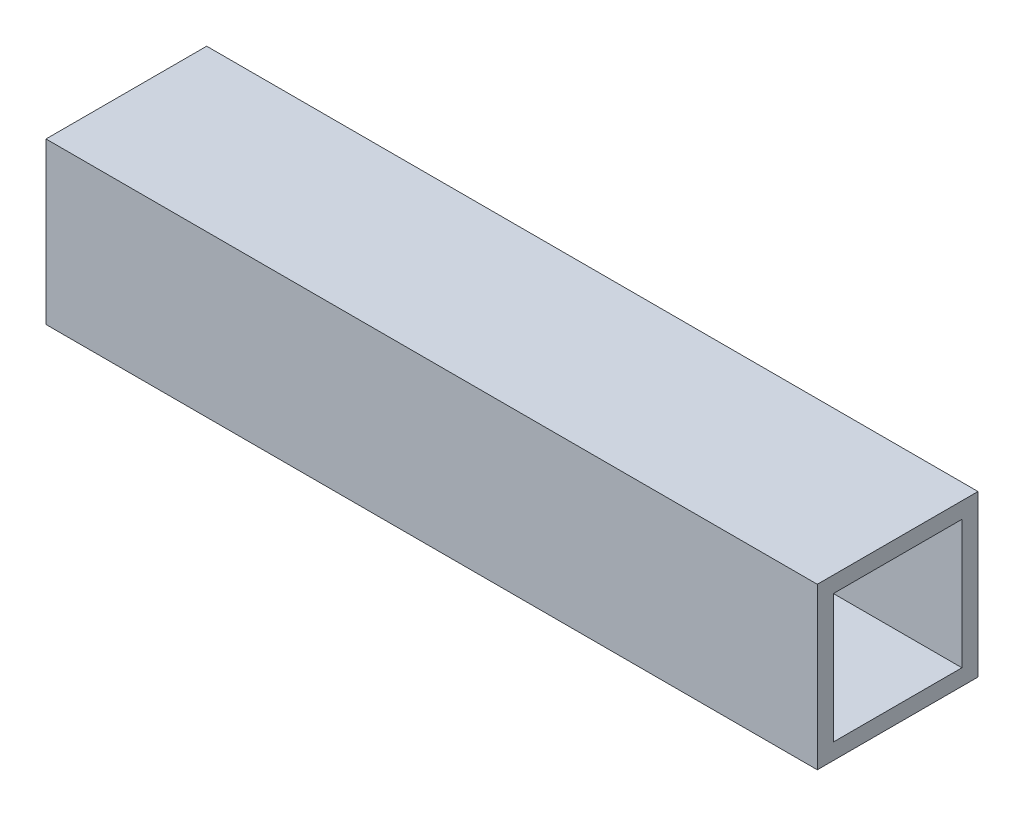
ISO-10303-21;
HEADER;
FILE_DESCRIPTION(('STEP AP214'),'2;1');
FILE_NAME('part.step','',(''),(''),'','','');
FILE_SCHEMA(('AUTOMOTIVE_DESIGN { 1 0 10303 214 1 1 1 1 }'));
ENDSEC;
DATA;
#1=APPLICATION_CONTEXT('core data for automotive mechanical design processes');
#2=APPLICATION_PROTOCOL_DEFINITION('international standard','automotive_design',2000,#1);
#3=PRODUCT_CONTEXT('',#1,'mechanical');
#4=PRODUCT('Part','Part','',(#3));
#5=PRODUCT_RELATED_PRODUCT_CATEGORY('part','',(#4));
#6=PRODUCT_DEFINITION_FORMATION('','',#4);
#7=PRODUCT_DEFINITION_CONTEXT('part definition',#1,'design');
#8=PRODUCT_DEFINITION('design','',#6,#7);
#9=PRODUCT_DEFINITION_SHAPE('','',#8);
#10=(LENGTH_UNIT() NAMED_UNIT(*) SI_UNIT(.MILLI.,.METRE.));
#11=(NAMED_UNIT(*) PLANE_ANGLE_UNIT() SI_UNIT($,.RADIAN.));
#12=(NAMED_UNIT(*) SI_UNIT($,.STERADIAN.) SOLID_ANGLE_UNIT());
#13=UNCERTAINTY_MEASURE_WITH_UNIT(LENGTH_MEASURE(1.E-05),#10,'distance_accuracy_value','');
#14=(GEOMETRIC_REPRESENTATION_CONTEXT(3) GLOBAL_UNCERTAINTY_ASSIGNED_CONTEXT((#13)) GLOBAL_UNIT_ASSIGNED_CONTEXT((#10,
#11,#12)) REPRESENTATION_CONTEXT('',''));
#15=CARTESIAN_POINT('',(0.,0.,0.));
#16=DIRECTION('',(0.,0.,1.));
#17=DIRECTION('',(1.,0.,0.));
#18=AXIS2_PLACEMENT_3D('',#15,#16,#17);
#19=CARTESIAN_POINT('',(152.4,0.,0.));
#20=DIRECTION('',(1.,0.,0.));
#21=DIRECTION('',(0.,0.,-1.));
#22=AXIS2_PLACEMENT_3D('',#19,#20,#21);
#23=PLANE('',#22);
#24=DIRECTION('',(0.,0.,-1.));
#25=VECTOR('',#24,1.);
#26=CARTESIAN_POINT('',(152.4,-31.75,31.75));
#27=LINE('',#26,#25);
#28=CARTESIAN_POINT('',(152.4,-31.75,31.75));
#29=VERTEX_POINT('',#28);
#30=CARTESIAN_POINT('',(152.4,-31.75,-31.75));
#31=VERTEX_POINT('',#30);
#32=EDGE_CURVE('E136',#29,#31,#27,.T.);
#33=ORIENTED_EDGE('',*,*,#32,.T.);
#34=DIRECTION('',(0.,1.,0.));
#35=VECTOR('',#34,1.);
#36=CARTESIAN_POINT('',(152.4,-31.75,-31.75));
#37=LINE('',#36,#35);
#38=CARTESIAN_POINT('',(152.4,31.75,-31.75));
#39=VERTEX_POINT('',#38);
#40=EDGE_CURVE('E139',#31,#39,#37,.T.);
#41=ORIENTED_EDGE('',*,*,#40,.T.);
#42=DIRECTION('',(0.,0.,1.));
#43=VECTOR('',#42,1.);
#44=CARTESIAN_POINT('',(152.4,31.75,31.75));
#45=LINE('',#44,#43);
#46=CARTESIAN_POINT('',(152.4,31.75,31.75));
#47=VERTEX_POINT('',#46);
#48=EDGE_CURVE('E142',#39,#47,#45,.T.);
#49=ORIENTED_EDGE('',*,*,#48,.T.);
#50=DIRECTION('',(0.,-1.,0.));
#51=VECTOR('',#50,1.);
#52=CARTESIAN_POINT('',(152.4,-31.75,31.75));
#53=LINE('',#52,#51);
#54=EDGE_CURVE('E144',#47,#29,#53,.T.);
#55=ORIENTED_EDGE('',*,*,#54,.T.);
#56=EDGE_LOOP('',(#33,#41,#49,#55));
#57=FACE_BOUND('',#56,.T.);
#58=DIRECTION('',(0.,0.,1.));
#59=VECTOR('',#58,1.);
#60=CARTESIAN_POINT('',(152.4,25.4,25.4));
#61=LINE('',#60,#59);
#62=CARTESIAN_POINT('',(152.4,25.4,-25.4));
#63=VERTEX_POINT('',#62);
#64=CARTESIAN_POINT('',(152.4,25.4,25.4));
#65=VERTEX_POINT('',#64);
#66=EDGE_CURVE('E108',#63,#65,#61,.T.);
#67=ORIENTED_EDGE('',*,*,#66,.F.);
#68=DIRECTION('',(0.,1.,0.));
#69=VECTOR('',#68,1.);
#70=CARTESIAN_POINT('',(152.4,-25.4,-25.4));
#71=LINE('',#70,#69);
#72=CARTESIAN_POINT('',(152.4,-25.4,-25.4));
#73=VERTEX_POINT('',#72);
#74=EDGE_CURVE('E100',#73,#63,#71,.T.);
#75=ORIENTED_EDGE('',*,*,#74,.F.);
#76=DIRECTION('',(0.,0.,-1.));
#77=VECTOR('',#76,1.);
#78=CARTESIAN_POINT('',(152.4,-25.4,25.4));
#79=LINE('',#78,#77);
#80=CARTESIAN_POINT('',(152.4,-25.4,25.4));
#81=VERTEX_POINT('',#80);
#82=EDGE_CURVE('E122',#81,#73,#79,.T.);
#83=ORIENTED_EDGE('',*,*,#82,.F.);
#84=DIRECTION('',(0.,-1.,0.));
#85=VECTOR('',#84,1.);
#86=CARTESIAN_POINT('',(152.4,-25.4,25.4));
#87=LINE('',#86,#85);
#88=EDGE_CURVE('E120',#65,#81,#87,.T.);
#89=ORIENTED_EDGE('',*,*,#88,.F.);
#90=EDGE_LOOP('',(#67,#75,#83,#89));
#91=FACE_BOUND('',#90,.T.);
#92=ADVANCED_FACE('F35',(#57,#91),#23,.T.);
#93=CARTESIAN_POINT('',(-152.4,0.,0.));
#94=DIRECTION('',(1.,0.,0.));
#95=DIRECTION('',(0.,0.,-1.));
#96=AXIS2_PLACEMENT_3D('',#93,#94,#95);
#97=PLANE('',#96);
#98=DIRECTION('',(0.,0.,-1.));
#99=VECTOR('',#98,1.);
#100=CARTESIAN_POINT('',(-152.4,-31.75,31.75));
#101=LINE('',#100,#99);
#102=CARTESIAN_POINT('',(-152.4,-31.75,31.75));
#103=VERTEX_POINT('',#102);
#104=CARTESIAN_POINT('',(-152.4,-31.75,-31.75));
#105=VERTEX_POINT('',#104);
#106=EDGE_CURVE('E116',#103,#105,#101,.T.);
#107=ORIENTED_EDGE('',*,*,#106,.F.);
#108=DIRECTION('',(0.,-1.,0.));
#109=VECTOR('',#108,1.);
#110=CARTESIAN_POINT('',(-152.4,-31.75,31.75));
#111=LINE('',#110,#109);
#112=CARTESIAN_POINT('',(-152.4,31.75,31.75));
#113=VERTEX_POINT('',#112);
#114=EDGE_CURVE('E140',#113,#103,#111,.T.);
#115=ORIENTED_EDGE('',*,*,#114,.F.);
#116=DIRECTION('',(0.,0.,1.));
#117=VECTOR('',#116,1.);
#118=CARTESIAN_POINT('',(-152.4,31.75,31.75));
#119=LINE('',#118,#117);
#120=CARTESIAN_POINT('',(-152.4,31.75,-31.75));
#121=VERTEX_POINT('',#120);
#122=EDGE_CURVE('E151',#121,#113,#119,.T.);
#123=ORIENTED_EDGE('',*,*,#122,.F.);
#124=DIRECTION('',(0.,1.,0.));
#125=VECTOR('',#124,1.);
#126=CARTESIAN_POINT('',(-152.4,-31.75,-31.75));
#127=LINE('',#126,#125);
#128=EDGE_CURVE('E149',#105,#121,#127,.T.);
#129=ORIENTED_EDGE('',*,*,#128,.F.);
#130=EDGE_LOOP('',(#107,#115,#123,#129));
#131=FACE_BOUND('',#130,.T.);
#132=DIRECTION('',(0.,1.,0.));
#133=VECTOR('',#132,1.);
#134=CARTESIAN_POINT('',(-152.4,-25.4,-25.4));
#135=LINE('',#134,#133);
#136=CARTESIAN_POINT('',(-152.4,-25.4,-25.4));
#137=VERTEX_POINT('',#136);
#138=CARTESIAN_POINT('',(-152.4,25.4,-25.4));
#139=VERTEX_POINT('',#138);
#140=EDGE_CURVE('E58',#137,#139,#135,.T.);
#141=ORIENTED_EDGE('',*,*,#140,.T.);
#142=DIRECTION('',(0.,0.,1.));
#143=VECTOR('',#142,1.);
#144=CARTESIAN_POINT('',(-152.4,25.4,25.4));
#145=LINE('',#144,#143);
#146=CARTESIAN_POINT('',(-152.4,25.4,25.4));
#147=VERTEX_POINT('',#146);
#148=EDGE_CURVE('E115',#139,#147,#145,.T.);
#149=ORIENTED_EDGE('',*,*,#148,.T.);
#150=DIRECTION('',(0.,-1.,0.));
#151=VECTOR('',#150,1.);
#152=CARTESIAN_POINT('',(-152.4,-25.4,25.4));
#153=LINE('',#152,#151);
#154=CARTESIAN_POINT('',(-152.4,-25.4,25.4));
#155=VERTEX_POINT('',#154);
#156=EDGE_CURVE('E128',#147,#155,#153,.T.);
#157=ORIENTED_EDGE('',*,*,#156,.T.);
#158=DIRECTION('',(0.,0.,-1.));
#159=VECTOR('',#158,1.);
#160=CARTESIAN_POINT('',(-152.4,-25.4,25.4));
#161=LINE('',#160,#159);
#162=EDGE_CURVE('E109',#155,#137,#161,.T.);
#163=ORIENTED_EDGE('',*,*,#162,.T.);
#164=EDGE_LOOP('',(#141,#149,#157,#163));
#165=FACE_BOUND('',#164,.T.);
#166=ADVANCED_FACE('F169',(#131,#165),#97,.F.);
#167=CARTESIAN_POINT('',(152.4,-31.75,31.75));
#168=DIRECTION('',(0.,1.,0.));
#169=DIRECTION('',(0.,0.,1.));
#170=AXIS2_PLACEMENT_3D('',#167,#168,#169);
#171=PLANE('',#170);
#172=ORIENTED_EDGE('',*,*,#106,.T.);
#173=DIRECTION('',(-1.,0.,0.));
#174=VECTOR('',#173,1.);
#175=CARTESIAN_POINT('',(152.4,-31.75,-31.75));
#176=LINE('',#175,#174);
#177=EDGE_CURVE('E11',#31,#105,#176,.T.);
#178=ORIENTED_EDGE('',*,*,#177,.F.);
#179=ORIENTED_EDGE('',*,*,#32,.F.);
#180=DIRECTION('',(-1.,0.,0.));
#181=VECTOR('',#180,1.);
#182=CARTESIAN_POINT('',(152.4,-31.75,31.75));
#183=LINE('',#182,#181);
#184=EDGE_CURVE('E146',#29,#103,#183,.T.);
#185=ORIENTED_EDGE('',*,*,#184,.T.);
#186=EDGE_LOOP('',(#172,#178,#179,#185));
#187=FACE_BOUND('',#186,.T.);
#188=ADVANCED_FACE('F37',(#187),#171,.F.);
#189=CARTESIAN_POINT('',(152.4,-31.75,-31.75));
#190=DIRECTION('',(0.,0.,1.));
#191=DIRECTION('',(1.,0.,0.));
#192=AXIS2_PLACEMENT_3D('',#189,#190,#191);
#193=PLANE('',#192);
#194=ORIENTED_EDGE('',*,*,#128,.T.);
#195=DIRECTION('',(-1.,0.,0.));
#196=VECTOR('',#195,1.);
#197=CARTESIAN_POINT('',(152.4,31.75,-31.75));
#198=LINE('',#197,#196);
#199=EDGE_CURVE('E43',#39,#121,#198,.T.);
#200=ORIENTED_EDGE('',*,*,#199,.F.);
#201=ORIENTED_EDGE('',*,*,#40,.F.);
#202=ORIENTED_EDGE('',*,*,#177,.T.);
#203=EDGE_LOOP('',(#194,#200,#201,#202));
#204=FACE_BOUND('',#203,.T.);
#205=ADVANCED_FACE('F179',(#204),#193,.F.);
#206=CARTESIAN_POINT('',(152.4,31.75,31.75));
#207=DIRECTION('',(0.,-1.,0.));
#208=DIRECTION('',(0.,0.,-1.));
#209=AXIS2_PLACEMENT_3D('',#206,#207,#208);
#210=PLANE('',#209);
#211=ORIENTED_EDGE('',*,*,#122,.T.);
#212=DIRECTION('',(-1.,0.,0.));
#213=VECTOR('',#212,1.);
#214=CARTESIAN_POINT('',(152.4,31.75,31.75));
#215=LINE('',#214,#213);
#216=EDGE_CURVE('E156',#47,#113,#215,.T.);
#217=ORIENTED_EDGE('',*,*,#216,.F.);
#218=ORIENTED_EDGE('',*,*,#48,.F.);
#219=ORIENTED_EDGE('',*,*,#199,.T.);
#220=EDGE_LOOP('',(#211,#217,#218,#219));
#221=FACE_BOUND('',#220,.T.);
#222=ADVANCED_FACE('F163',(#221),#210,.F.);
#223=CARTESIAN_POINT('',(152.4,-31.75,31.75));
#224=DIRECTION('',(0.,0.,-1.));
#225=DIRECTION('',(-1.,0.,0.));
#226=AXIS2_PLACEMENT_3D('',#223,#224,#225);
#227=PLANE('',#226);
#228=ORIENTED_EDGE('',*,*,#114,.T.);
#229=ORIENTED_EDGE('',*,*,#184,.F.);
#230=ORIENTED_EDGE('',*,*,#54,.F.);
#231=ORIENTED_EDGE('',*,*,#216,.T.);
#232=EDGE_LOOP('',(#228,#229,#230,#231));
#233=FACE_BOUND('',#232,.T.);
#234=ADVANCED_FACE('F173',(#233),#227,.F.);
#235=CARTESIAN_POINT('',(152.4,-25.4,-25.4));
#236=DIRECTION('',(0.,0.,1.));
#237=DIRECTION('',(1.,0.,0.));
#238=AXIS2_PLACEMENT_3D('',#235,#236,#237);
#239=PLANE('',#238);
#240=ORIENTED_EDGE('',*,*,#140,.F.);
#241=DIRECTION('',(-1.,0.,0.));
#242=VECTOR('',#241,1.);
#243=CARTESIAN_POINT('',(152.4,-25.4,-25.4));
#244=LINE('',#243,#242);
#245=EDGE_CURVE('E104',#73,#137,#244,.T.);
#246=ORIENTED_EDGE('',*,*,#245,.F.);
#247=ORIENTED_EDGE('',*,*,#74,.T.);
#248=DIRECTION('',(-1.,0.,0.));
#249=VECTOR('',#248,1.);
#250=CARTESIAN_POINT('',(152.4,25.4,-25.4));
#251=LINE('',#250,#249);
#252=EDGE_CURVE('E103',#63,#139,#251,.T.);
#253=ORIENTED_EDGE('',*,*,#252,.T.);
#254=EDGE_LOOP('',(#240,#246,#247,#253));
#255=FACE_BOUND('',#254,.T.);
#256=ADVANCED_FACE('F102',(#255),#239,.T.);
#257=CARTESIAN_POINT('',(152.4,25.4,25.4));
#258=DIRECTION('',(0.,-1.,0.));
#259=DIRECTION('',(0.,0.,-1.));
#260=AXIS2_PLACEMENT_3D('',#257,#258,#259);
#261=PLANE('',#260);
#262=ORIENTED_EDGE('',*,*,#148,.F.);
#263=ORIENTED_EDGE('',*,*,#252,.F.);
#264=ORIENTED_EDGE('',*,*,#66,.T.);
#265=DIRECTION('',(-1.,0.,0.));
#266=VECTOR('',#265,1.);
#267=CARTESIAN_POINT('',(152.4,25.4,25.4));
#268=LINE('',#267,#266);
#269=EDGE_CURVE('E117',#65,#147,#268,.T.);
#270=ORIENTED_EDGE('',*,*,#269,.T.);
#271=EDGE_LOOP('',(#262,#263,#264,#270));
#272=FACE_BOUND('',#271,.T.);
#273=ADVANCED_FACE('F112',(#272),#261,.T.);
#274=CARTESIAN_POINT('',(152.4,-25.4,25.4));
#275=DIRECTION('',(0.,0.,-1.));
#276=DIRECTION('',(-1.,0.,0.));
#277=AXIS2_PLACEMENT_3D('',#274,#275,#276);
#278=PLANE('',#277);
#279=ORIENTED_EDGE('',*,*,#156,.F.);
#280=ORIENTED_EDGE('',*,*,#269,.F.);
#281=ORIENTED_EDGE('',*,*,#88,.T.);
#282=DIRECTION('',(-1.,0.,0.));
#283=VECTOR('',#282,1.);
#284=CARTESIAN_POINT('',(152.4,-25.4,25.4));
#285=LINE('',#284,#283);
#286=EDGE_CURVE('E50',#81,#155,#285,.T.);
#287=ORIENTED_EDGE('',*,*,#286,.T.);
#288=EDGE_LOOP('',(#279,#280,#281,#287));
#289=FACE_BOUND('',#288,.T.);
#290=ADVANCED_FACE('F202',(#289),#278,.T.);
#291=CARTESIAN_POINT('',(152.4,-25.4,25.4));
#292=DIRECTION('',(0.,1.,0.));
#293=DIRECTION('',(0.,0.,1.));
#294=AXIS2_PLACEMENT_3D('',#291,#292,#293);
#295=PLANE('',#294);
#296=ORIENTED_EDGE('',*,*,#162,.F.);
#297=ORIENTED_EDGE('',*,*,#286,.F.);
#298=ORIENTED_EDGE('',*,*,#82,.T.);
#299=ORIENTED_EDGE('',*,*,#245,.T.);
#300=EDGE_LOOP('',(#296,#297,#298,#299));
#301=FACE_BOUND('',#300,.T.);
#302=ADVANCED_FACE('F206',(#301),#295,.T.);
#303=CLOSED_SHELL('',(#92,#166,#188,#205,#222,#234,#256,#273,#290,#302));
#304=MANIFOLD_SOLID_BREP('B2',#303);
#305=ADVANCED_BREP_SHAPE_REPRESENTATION('',(#18,#304),#14);
#306=SHAPE_DEFINITION_REPRESENTATION(#9,#305);
ENDSEC;
END-ISO-10303-21;
